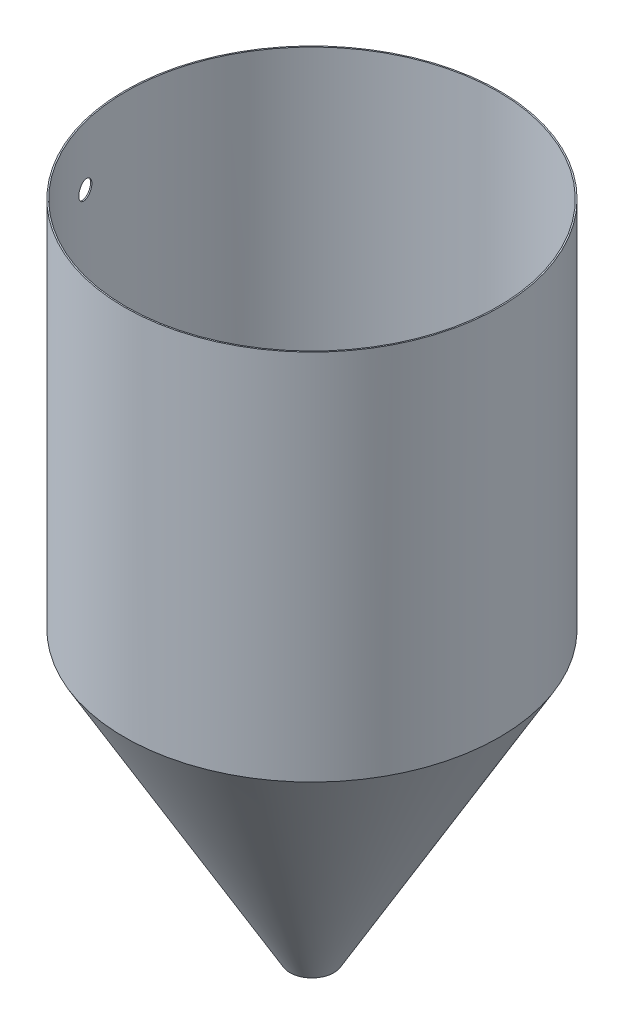
ISO-10303-21;
HEADER;
FILE_DESCRIPTION(('STEP AP214'),'2;1');
FILE_NAME('part.step','',(''),(''),'','','');
FILE_SCHEMA(('AUTOMOTIVE_DESIGN { 1 0 10303 214 1 1 1 1 }'));
ENDSEC;
DATA;
#1=APPLICATION_CONTEXT('core data for automotive mechanical design processes');
#2=APPLICATION_PROTOCOL_DEFINITION('international standard','automotive_design',2000,#1);
#3=PRODUCT_CONTEXT('',#1,'mechanical');
#4=PRODUCT('Part','Part','',(#3));
#5=PRODUCT_RELATED_PRODUCT_CATEGORY('part','',(#4));
#6=PRODUCT_DEFINITION_FORMATION('','',#4);
#7=PRODUCT_DEFINITION_CONTEXT('part definition',#1,'design');
#8=PRODUCT_DEFINITION('design','',#6,#7);
#9=PRODUCT_DEFINITION_SHAPE('','',#8);
#10=(LENGTH_UNIT() NAMED_UNIT(*) SI_UNIT(.MILLI.,.METRE.));
#11=(NAMED_UNIT(*) PLANE_ANGLE_UNIT() SI_UNIT($,.RADIAN.));
#12=(NAMED_UNIT(*) SI_UNIT($,.STERADIAN.) SOLID_ANGLE_UNIT());
#13=UNCERTAINTY_MEASURE_WITH_UNIT(LENGTH_MEASURE(1.E-05),#10,'distance_accuracy_value','');
#14=(GEOMETRIC_REPRESENTATION_CONTEXT(3) GLOBAL_UNCERTAINTY_ASSIGNED_CONTEXT((#13)) GLOBAL_UNIT_ASSIGNED_CONTEXT((#10,
#11,#12)) REPRESENTATION_CONTEXT('',''));
#15=CARTESIAN_POINT('',(0.,0.,0.));
#16=DIRECTION('',(0.,0.,1.));
#17=DIRECTION('',(1.,0.,0.));
#18=AXIS2_PLACEMENT_3D('',#15,#16,#17);
#19=CARTESIAN_POINT('',(0.,457.2,0.));
#20=DIRECTION('',(0.,1.,0.));
#21=DIRECTION('',(0.,0.,1.));
#22=AXIS2_PLACEMENT_3D('',#19,#20,#21);
#23=PLANE('',#22);
#24=CARTESIAN_POINT('',(0.,457.2,0.));
#25=DIRECTION('',(0.,1.,0.));
#26=DIRECTION('',(0.,0.,1.));
#27=AXIS2_PLACEMENT_3D('',#24,#25,#26);
#28=CIRCLE('',#27,230.1875);
#29=CARTESIAN_POINT('',(0.,457.2,230.1875));
#30=VERTEX_POINT('',#29);
#31=EDGE_CURVE('E10',#30,#30,#28,.T.);
#32=ORIENTED_EDGE('',*,*,#31,.T.);
#33=EDGE_LOOP('',(#32));
#34=FACE_BOUND('',#33,.T.);
#35=CARTESIAN_POINT('',(0.,457.2,0.));
#36=DIRECTION('',(0.,1.,0.));
#37=DIRECTION('',(0.,0.,1.));
#38=AXIS2_PLACEMENT_3D('',#35,#36,#37);
#39=CIRCLE('',#38,228.6);
#40=CARTESIAN_POINT('',(0.,457.2,228.6));
#41=VERTEX_POINT('',#40);
#42=EDGE_CURVE('E46',#41,#41,#39,.T.);
#43=ORIENTED_EDGE('',*,*,#42,.F.);
#44=EDGE_LOOP('',(#43));
#45=FACE_BOUND('',#44,.T.);
#46=ADVANCED_FACE('F33',(#34,#45),#23,.T.);
#47=CARTESIAN_POINT('',(0.,457.2,0.));
#48=DIRECTION('',(0.,-1.,0.));
#49=DIRECTION('',(0.,0.,-1.));
#50=AXIS2_PLACEMENT_3D('',#47,#48,#49);
#51=CYLINDRICAL_SURFACE('',#50,230.1875);
#52=CARTESIAN_POINT('',(-225.471725791174,384.980800527484,46.3549999999982));
#53=CARTESIAN_POINT('',(-225.471726088794,385.279183677529,46.3549976588101));
#54=CARTESIAN_POINT('',(-225.469182138422,385.577530948555,46.3673773098593));
#55=CARTESIAN_POINT('',(-225.459013423752,386.17218672122,46.4167973755981));
#56=CARTESIAN_POINT('',(-225.451387320096,386.46849466461,46.4538442911281));
#57=CARTESIAN_POINT('',(-225.431065189782,387.057163545417,46.5523632633025));
#58=CARTESIAN_POINT('',(-225.418363787371,387.349519956839,46.6138612181259));
#59=CARTESIAN_POINT('',(-225.387930993322,387.927889205815,46.7607885061345));
#60=CARTESIAN_POINT('',(-225.370199590479,388.213902029236,46.8462178926335));
#61=CARTESIAN_POINT('',(-225.329781164068,388.777323163729,47.0402453109299));
#62=CARTESIAN_POINT('',(-225.307098342538,389.054738544451,47.1488236954465));
#63=CARTESIAN_POINT('',(-225.25684386315,389.599287527111,47.3883362421777));
#64=CARTESIAN_POINT('',(-225.229272135459,389.866420982117,47.5192707237242));
#65=CARTESIAN_POINT('',(-225.169343533614,390.388500994832,47.8024352432938));
#66=CARTESIAN_POINT('',(-225.136987843247,390.643450546846,47.9546600125473));
#67=CARTESIAN_POINT('',(-225.067604161718,391.13951216302,48.2792527346957));
#68=CARTESIAN_POINT('',(-225.030576158499,391.380624191464,48.4516207395778));
#69=CARTESIAN_POINT('',(-224.95168816233,391.849203572208,48.8165776786266));
#70=CARTESIAN_POINT('',(-224.909793367589,392.076552415832,49.009311232157));
#71=CARTESIAN_POINT('',(-224.82157318955,392.514091797104,49.412427015295));
#72=CARTESIAN_POINT('',(-224.775247790577,392.724282274043,49.6228093073412));
#73=CARTESIAN_POINT('',(-224.678359959954,393.126181476977,50.0596620976033));
#74=CARTESIAN_POINT('',(-224.627797224015,393.317888873552,50.2861337510362));
#75=CARTESIAN_POINT('',(-224.522660789154,393.681630752221,50.7534955612667));
#76=CARTESIAN_POINT('',(-224.468086913849,393.853664368346,50.9943863520316));
#77=CARTESIAN_POINT('',(-224.354073254658,394.180207844103,51.4937065704249));
#78=CARTESIAN_POINT('',(-224.294558936594,394.334307013736,51.7523875930294));
#79=CARTESIAN_POINT('',(-224.171924899898,394.620069933713,52.2810373257607));
#80=CARTESIAN_POINT('',(-224.108805141726,394.75173343794,52.5510061596739));
#81=CARTESIAN_POINT('',(-223.979285579249,394.991895096249,53.1003240690077));
#82=CARTESIAN_POINT('',(-223.912885491278,395.100391242593,53.379673954987));
#83=CARTESIAN_POINT('',(-223.777170953878,395.293631772445,53.9457842789963));
#84=CARTESIAN_POINT('',(-223.707856430761,395.378375554977,54.2325449043304));
#85=CARTESIAN_POINT('',(-223.564911636558,395.525540021225,54.8188724495469));
#86=CARTESIAN_POINT('',(-223.491216468101,395.587339147854,55.1185796509497));
#87=CARTESIAN_POINT('',(-223.341627982758,395.685242128482,55.7216194870634));
#88=CARTESIAN_POINT('',(-223.265734630626,395.721345570239,56.02495217986));
#89=CARTESIAN_POINT('',(-223.112226899023,395.767735355436,56.6331859444567));
#90=CARTESIAN_POINT('',(-223.03461233182,395.77801886861,56.9380871845238));
#91=CARTESIAN_POINT('',(-222.87818526465,395.772785724855,57.5473597713642));
#92=CARTESIAN_POINT('',(-222.7993727517,395.757268788114,57.8517311123547));
#93=CARTESIAN_POINT('',(-222.639311438267,395.699960387531,58.4647307553308));
#94=CARTESIAN_POINT('',(-222.558047718419,395.657585642148,58.7733007656623));
#95=CARTESIAN_POINT('',(-222.395446043872,395.546352405472,59.3856134716125));
#96=CARTESIAN_POINT('',(-222.314108087954,395.477493471184,59.689356086396));
#97=CARTESIAN_POINT('',(-222.152007554056,395.313764007605,60.2898615769973));
#98=CARTESIAN_POINT('',(-222.0712449027,395.218896858742,60.586625354453));
#99=CARTESIAN_POINT('',(-221.910913717958,395.003701129131,61.1712633081152));
#100=CARTESIAN_POINT('',(-221.83134571536,394.883361569628,61.4591335896684));
#101=CARTESIAN_POINT('',(-221.673587554066,394.617076271921,62.0257431961409));
#102=CARTESIAN_POINT('',(-221.595410575798,394.470960693891,62.3044064204936));
#103=CARTESIAN_POINT('',(-221.441755687704,394.154669812374,62.8483399904903));
#104=CARTESIAN_POINT('',(-221.36627660015,393.98450517196,63.1136162014154));
#105=CARTESIAN_POINT('',(-221.218701417868,393.621093980062,63.6289490949543));
#106=CARTESIAN_POINT('',(-221.146605998273,393.427842849246,63.8790027431908));
#107=CARTESIAN_POINT('',(-221.006558424579,393.019520060319,64.3618636600715));
#108=CARTESIAN_POINT('',(-220.938606185424,392.804448850398,64.5946712827839));
#109=CARTESIAN_POINT('',(-220.808804060588,392.358088533879,65.0369845114161));
#110=CARTESIAN_POINT('',(-220.746864245304,392.127175043213,65.2468427247918));
#111=CARTESIAN_POINT('',(-220.628380810602,391.647221640689,65.6463720606007));
#112=CARTESIAN_POINT('',(-220.571836876717,391.398182786654,65.8360443595246));
#113=CARTESIAN_POINT('',(-220.464814703941,390.883716349776,66.1935454605426));
#114=CARTESIAN_POINT('',(-220.414335513676,390.618291347338,66.3613776890249));
#115=CARTESIAN_POINT('',(-220.320058392862,390.072921802553,66.6737103623572));
#116=CARTESIAN_POINT('',(-220.276260227155,389.79297777171,66.8182116284171));
#117=CARTESIAN_POINT('',(-220.197492238482,389.231917254212,67.0773224366206));
#118=CARTESIAN_POINT('',(-220.162243127203,388.95127913094,67.1928834748647));
#119=CARTESIAN_POINT('',(-220.098874600913,388.380549999233,67.4001655350726));
#120=CARTESIAN_POINT('',(-220.070755007299,388.090459227802,67.4918871542387));
#121=CARTESIAN_POINT('',(-220.02201379894,387.503039232471,67.6506134543909));
#122=CARTESIAN_POINT('',(-220.00139062343,387.205711529081,67.7176232804492));
#123=CARTESIAN_POINT('',(-219.967908274268,386.606030605093,67.8263055857097));
#124=CARTESIAN_POINT('',(-219.955048908892,386.303677508783,67.8679786905943));
#125=CARTESIAN_POINT('',(-219.937600356854,385.707682977434,67.9245017668396));
#126=CARTESIAN_POINT('',(-219.932719449883,385.414139412999,67.9402979392579));
#127=CARTESIAN_POINT('',(-219.930372182649,384.826717167376,67.9478959720372));
#128=CARTESIAN_POINT('',(-219.932905611584,384.532838495953,67.9396985145751));
#129=CARTESIAN_POINT('',(-219.945354127785,383.946911589704,67.899387299473));
#130=CARTESIAN_POINT('',(-219.955268569357,383.654863197018,67.8672756338522));
#131=CARTESIAN_POINT('',(-219.982353570734,383.074682834464,67.7794318482165));
#132=CARTESIAN_POINT('',(-219.999524139756,382.786550869571,67.7236996981974));
#133=CARTESIAN_POINT('',(-220.040674977499,382.2194730935,67.5898760682495));
#134=CARTESIAN_POINT('',(-220.064576362939,381.940460366908,67.5120435158373));
#135=CARTESIAN_POINT('',(-220.118980802515,381.390172979682,67.3344493053306));
#136=CARTESIAN_POINT('',(-220.149483775423,381.118898223883,67.2346879170563));
#137=CARTESIAN_POINT('',(-220.216742003339,380.585867274134,67.0140655925355));
#138=CARTESIAN_POINT('',(-220.253497448164,380.324111369455,66.8932040157129));
#139=CARTESIAN_POINT('',(-220.332854174001,379.811783681689,66.6313532360659));
#140=CARTESIAN_POINT('',(-220.37545576305,379.561212488852,66.4903629726349));
#141=CARTESIAN_POINT('',(-220.467012914423,379.067616583437,66.1861550930379));
#142=CARTESIAN_POINT('',(-220.516084168104,378.824865008656,66.0225291449194));
#143=CARTESIAN_POINT('',(-220.619329614987,378.354135538404,65.6767014201152));
#144=CARTESIAN_POINT('',(-220.673503858517,378.126157788677,65.4944994602237));
#145=CARTESIAN_POINT('',(-220.78641603957,377.686293057841,65.1128500601749));
#146=CARTESIAN_POINT('',(-220.845154560295,377.474408139865,64.9134004158175));
#147=CARTESIAN_POINT('',(-220.966627647439,377.06795962211,64.4986922472346));
#148=CARTESIAN_POINT('',(-221.029362364982,376.873396678063,64.2834331250969));
#149=CARTESIAN_POINT('',(-221.160816478872,376.495304139711,63.829745128254));
#150=CARTESIAN_POINT('',(-221.229674584822,376.312519044427,63.5907357219956));
#151=CARTESIAN_POINT('',(-221.370451583808,375.967890763984,63.0989202902954));
#152=CARTESIAN_POINT('',(-221.442370549892,375.806048078993,62.846113935546));
#153=CARTESIAN_POINT('',(-221.588644353269,375.504201426446,62.3284060712114));
#154=CARTESIAN_POINT('',(-221.662999545691,375.364200660074,62.0635027960249));
#155=CARTESIAN_POINT('',(-221.813513230159,375.106851814315,61.523402825781));
#156=CARTESIAN_POINT('',(-221.889671770537,374.98950434284,61.2482058547233));
#157=CARTESIAN_POINT('',(-222.045912361497,374.774373046555,60.6793868831122));
#158=CARTESIAN_POINT('',(-222.126037687907,374.677432181546,60.385457633595));
#159=CARTESIAN_POINT('',(-222.286917321503,374.509160687855,59.7905218498463));
#160=CARTESIAN_POINT('',(-222.367671643997,374.437830684443,59.4895151430151));
#161=CARTESIAN_POINT('',(-222.529188522209,374.321244094155,58.882459746569));
#162=CARTESIAN_POINT('',(-222.609951077895,374.275990261807,58.5764105278046));
#163=CARTESIAN_POINT('',(-222.770871995751,374.211899659563,57.9614076397001));
#164=CARTESIAN_POINT('',(-222.851030369404,374.193062386304,57.6524540258156));
#165=CARTESIAN_POINT('',(-223.011295370396,374.181915307042,57.0293977683801));
#166=CARTESIAN_POINT('',(-223.091385315407,374.189983475448,56.7152839718901));
#167=CARTESIAN_POINT('',(-223.249791121739,374.233524511017,56.0885051564206));
#168=CARTESIAN_POINT('',(-223.328106959608,374.268997740251,55.7758401566372));
#169=CARTESIAN_POINT('',(-223.482430401741,374.367224298065,55.1542474114872));
#170=CARTESIAN_POINT('',(-223.558438031742,374.42997732237,54.8453196244755));
#171=CARTESIAN_POINT('',(-223.707647498081,374.582461507265,54.2335021505579));
#172=CARTESIAN_POINT('',(-223.780849371612,374.672192310099,53.9306123836373));
#173=CARTESIAN_POINT('',(-223.923261508005,374.877098050646,53.3362032487478));
#174=CARTESIAN_POINT('',(-223.992504680613,374.99200617828,53.0445998084584));
#175=CARTESIAN_POINT('',(-224.127379304272,375.247109429878,52.4717979805745));
#176=CARTESIAN_POINT('',(-224.193010764123,375.387304492233,52.1905995676308));
#177=CARTESIAN_POINT('',(-224.320278851407,375.69209525945,51.6408487681667));
#178=CARTESIAN_POINT('',(-224.381915991765,375.856687822394,51.3722947591548));
#179=CARTESIAN_POINT('',(-224.50086656005,376.209214687905,50.8499540594912));
#180=CARTESIAN_POINT('',(-224.558180080396,376.397148491318,50.5961670532161));
#181=CARTESIAN_POINT('',(-224.666842556259,376.790225712222,50.1114279861869));
#182=CARTESIAN_POINT('',(-224.718302833041,376.994838091978,49.8800701507542));
#183=CARTESIAN_POINT('',(-224.816578417777,377.423686676857,49.4352416788607));
#184=CARTESIAN_POINT('',(-224.863393772102,377.647922686037,49.2217708638395));
#185=CARTESIAN_POINT('',(-224.952173738837,378.114495294457,48.8144257673208));
#186=CARTESIAN_POINT('',(-224.994137607427,378.356834659923,48.6205544913644));
#187=CARTESIAN_POINT('',(-225.073023874237,378.857844706535,48.2540592154279));
#188=CARTESIAN_POINT('',(-225.109946441011,379.116514841252,48.0814345051057));
#189=CARTESIAN_POINT('',(-225.177752425007,379.641733463271,47.7628605301758));
#190=CARTESIAN_POINT('',(-225.20876228545,379.907930511002,47.6163585498022));
#191=CARTESIAN_POINT('',(-225.26572690163,380.452162771174,47.3461351867414));
#192=CARTESIAN_POINT('',(-225.291681749866,380.73019776688,47.2224133872069));
#193=CARTESIAN_POINT('',(-225.338416379941,381.29576760747,46.9988967528108));
#194=CARTESIAN_POINT('',(-225.359202265591,381.583290789102,46.8990737021575));
#195=CARTESIAN_POINT('',(-225.395562110896,382.165943506996,46.7240164888562));
#196=CARTESIAN_POINT('',(-225.411137537809,382.461070876673,46.6487754041032));
#197=CARTESIAN_POINT('',(-225.43993910364,383.12372466068,46.5094102623226));
#198=CARTESIAN_POINT('',(-225.451855226266,383.492645624152,46.4515625927159));
#199=CARTESIAN_POINT('',(-225.467748345371,384.23466328785,46.3743591122761));
#200=CARTESIAN_POINT('',(-225.471725419086,384.607759947418,46.355002926967));
#201=CARTESIAN_POINT('',(-225.471725791174,384.980800527484,46.3549999999982));
#202=B_SPLINE_CURVE_WITH_KNOTS('',3,(#52,#53,#54,#55,#56,#57,#58,#59,#60,#61,#62,#63,#64,#65,
#66,#67,#68,#69,#70,#71,#72,#73,#74,#75,#76,#77,#78,#79,#80,#81,#82,#83,#84,#85,#86,#87,#88,#89,
#90,#91,#92,#93,#94,#95,#96,#97,#98,#99,#100,#101,#102,#103,#104,#105,#106,#107,#108,#109,#110,
#111,#112,#113,#114,#115,#116,#117,#118,#119,#120,#121,#122,#123,#124,#125,#126,#127,#128,#129,
#130,#131,#132,#133,#134,#135,#136,#137,#138,#139,#140,#141,#142,#143,#144,#145,#146,#147,#148,
#149,#150,#151,#152,#153,#154,#155,#156,#157,#158,#159,#160,#161,#162,#163,#164,#165,#166,#167,
#168,#169,#170,#171,#172,#173,#174,#175,#176,#177,#178,#179,#180,#181,#182,#183,#184,#185,#186,
#187,#188,#189,#190,#191,#192,#193,#194,#195,#196,#197,#198,#199,#200,#201),.UNSPECIFIED.,.T.,
.F.,(4,2,2,2,2,2,2,2,2,2,2,2,2,2,2,2,2,2,2,2,2,2,2,2,2,2,2,2,2,2,2,2,2,2,2,2,2,2,2,2,2,2,2,2,2,
2,2,2,2,2,2,2,2,2,2,2,2,2,2,2,2,2,2,2,2,2,2,2,2,2,2,2,2,2,4),(0.,0.894820422795079,
1.78987676102129,2.68588366607302,3.58189256724735,4.47714400357919,5.37240822865174,
6.26745129080843,7.16249666301003,8.064389980403,8.96628648869571,9.86824781878641,
10.7702488346591,11.6899712782463,12.6097038104996,13.5295160166542,14.4493514935404,
15.3925465453272,16.3357567287412,17.2790702982015,18.2223940981911,19.1869412131289,
20.1515044625287,21.1159424018401,22.0807968689061,23.0522639775039,24.0233016925047,
24.9945323389736,25.9657430401358,26.918906989603,27.8720153555815,28.824974012038,
29.7778991186716,30.6933777590411,31.6088334635093,32.5240984595009,33.4393408523929,
34.3203027320705,35.2012395648526,36.082099342173,36.9629602384231,37.8338990855472,
38.7048272169265,39.5757817932225,40.4467822781885,41.3362736413983,42.2257737780546,
43.1153877585095,44.0050354013867,44.929996220813,45.8549791270115,46.7800974729607,
47.7052406414989,48.6632450691949,49.6212728842781,50.579401881077,51.5375126206797,
52.5091395230254,53.4807792625726,54.4524081648538,55.4240241827538,56.3858029660815,
57.3475794061292,58.3092320957178,59.2708642238021,60.2090604238087,61.1472472569907,
62.0855777412788,63.0238768455884,63.939043948775,64.8541943039461,65.7682588091638,
66.6820656980959,67.8007869700097,68.919497358057),.UNSPECIFIED.);
#203=CARTESIAN_POINT('',(-225.471725791174,384.980800527484,46.3549999999982));
#204=VERTEX_POINT('',#203);
#205=EDGE_CURVE('E64',#204,#204,#202,.T.);
#206=ORIENTED_EDGE('',*,*,#205,.T.);
#207=EDGE_LOOP('',(#206));
#208=FACE_BOUND('',#207,.T.);
#209=ORIENTED_EDGE('',*,*,#31,.F.);
#210=EDGE_LOOP('',(#209));
#211=FACE_BOUND('',#210,.T.);
#212=CARTESIAN_POINT('',(0.,0.,0.));
#213=DIRECTION('',(0.,1.,0.));
#214=DIRECTION('',(-1.,0.,0.));
#215=AXIS2_PLACEMENT_3D('',#212,#213,#214);
#216=CIRCLE('',#215,230.1875);
#217=CARTESIAN_POINT('',(-230.1875,0.,0.));
#218=VERTEX_POINT('',#217);
#219=EDGE_CURVE('E61',#218,#218,#216,.T.);
#220=ORIENTED_EDGE('',*,*,#219,.T.);
#221=EDGE_LOOP('',(#220));
#222=FACE_BOUND('',#221,.T.);
#223=ADVANCED_FACE('F35',(#208,#211,#222),#51,.T.);
#224=CARTESIAN_POINT('',(0.,457.2,0.));
#225=DIRECTION('',(0.,-1.,0.));
#226=DIRECTION('',(0.,0.,-1.));
#227=AXIS2_PLACEMENT_3D('',#224,#225,#226);
#228=CYLINDRICAL_SURFACE('',#227,228.6);
#229=CARTESIAN_POINT('',(-223.85078506675,384.980800527484,46.3549999999982));
#230=CARTESIAN_POINT('',(-223.850785366799,385.279114677653,46.3549976583635));
#231=CARTESIAN_POINT('',(-223.848224177078,385.57739296995,46.3673715999824));
#232=CARTESIAN_POINT('',(-223.837986585816,386.171911004515,46.4167687084857));
#233=CARTESIAN_POINT('',(-223.830308835498,386.468150188444,46.4537983748606));
#234=CARTESIAN_POINT('',(-223.809849181659,387.056682028594,46.5522709451281));
#235=CARTESIAN_POINT('',(-223.797061865881,387.348970159216,46.6137397355732));
#236=CARTESIAN_POINT('',(-223.766423438356,387.927203871506,46.7605962585818));
#237=CARTESIAN_POINT('',(-223.748572314906,388.213149438514,46.8459840464288));
#238=CARTESIAN_POINT('',(-223.707881453922,388.776436353699,47.0399146852138));
#239=CARTESIAN_POINT('',(-223.685045972227,389.053784813104,47.1484377804912));
#240=CARTESIAN_POINT('',(-223.634453821293,389.598202714085,47.3878256557009));
#241=CARTESIAN_POINT('',(-223.606697081832,389.865272008921,47.5186907544298));
#242=CARTESIAN_POINT('',(-223.546367072192,390.38722781328,47.8017017004241));
#243=CARTESIAN_POINT('',(-223.513794993227,390.642117315253,47.9538422840737));
#244=CARTESIAN_POINT('',(-223.443948189745,391.138064564664,48.2782511608146));
#245=CARTESIAN_POINT('',(-223.406673452699,391.379122275247,48.4505195075329));
#246=CARTESIAN_POINT('',(-223.327256764453,391.847624498763,48.8152791814765));
#247=CARTESIAN_POINT('',(-223.28507931212,392.07494895388,49.0079169678339));
#248=CARTESIAN_POINT('',(-223.196264730558,392.512446042426,49.4108283088885));
#249=CARTESIAN_POINT('',(-223.149627585379,392.722618614508,49.621101926658));
#250=CARTESIAN_POINT('',(-223.052088689399,393.12449083293,50.0577242793516));
#251=CARTESIAN_POINT('',(-223.00118662993,393.316189140052,50.2840741775975));
#252=CARTESIAN_POINT('',(-222.895345674203,393.679924063615,50.7511794676336));
#253=CARTESIAN_POINT('',(-222.840406599216,393.851959808678,50.9919354971352));
#254=CARTESIAN_POINT('',(-222.725615415398,394.178565993885,51.4910389471948));
#255=CARTESIAN_POINT('',(-222.665687235179,394.332720225186,51.7496412662697));
#256=CARTESIAN_POINT('',(-222.542200507265,394.618598236876,52.27812758374));
#257=CARTESIAN_POINT('',(-222.478641919197,394.750321767753,52.548011707589));
#258=CARTESIAN_POINT('',(-222.348221905992,394.990610880901,53.0971548619483));
#259=CARTESIAN_POINT('',(-222.281360191572,395.099174430416,53.3764147128801));
#260=CARTESIAN_POINT('',(-222.144702042697,395.292559280618,53.9423404371074));
#261=CARTESIAN_POINT('',(-222.074905533053,395.377379972585,54.2290065000779));
#262=CARTESIAN_POINT('',(-221.930940863794,395.524738009444,54.8152433415789));
#263=CARTESIAN_POINT('',(-221.856706410747,395.586645217446,55.1149563320913));
#264=CARTESIAN_POINT('',(-221.706021744098,395.684760393676,55.7180089437285));
#265=CARTESIAN_POINT('',(-221.629571494483,395.720967943954,56.0213486237523));
#266=CARTESIAN_POINT('',(-221.47493541134,395.767563353527,56.629598819));
#267=CARTESIAN_POINT('',(-221.396749386046,395.777948345501,56.934509504901));
#268=CARTESIAN_POINT('',(-221.239168324846,395.772916341071,57.5438043900746));
#269=CARTESIAN_POINT('',(-221.15977327553,395.757499058262,57.8481885834658));
#270=CARTESIAN_POINT('',(-220.998499500558,395.700381257109,58.4613203420482));
#271=CARTESIAN_POINT('',(-220.916605455537,395.658088693177,58.7700088622402));
#272=CARTESIAN_POINT('',(-220.752739155159,395.547000700097,59.3825621261169));
#273=CARTESIAN_POINT('',(-220.6707668985,395.478204821327,59.6864267878753));
#274=CARTESIAN_POINT('',(-220.507398480813,395.314581578141,60.2871802786808));
#275=CARTESIAN_POINT('',(-220.426002247103,395.219757560291,60.584069999207));
#276=CARTESIAN_POINT('',(-220.2644093868,395.004627017764,61.1689632031178));
#277=CARTESIAN_POINT('',(-220.184213293614,394.884309502617,61.4569627923407));
#278=CARTESIAN_POINT('',(-220.025195619606,394.618028386066,62.023870977765));
#279=CARTESIAN_POINT('',(-219.946387545339,394.471891586237,62.3027020596631));
#280=CARTESIAN_POINT('',(-219.791488718914,394.155526805605,62.846969049015));
#281=CARTESIAN_POINT('',(-219.715396780532,393.985309506819,63.1124108254662));
#282=CARTESIAN_POINT('',(-219.56662031793,393.621759503745,63.6280698980151));
#283=CARTESIAN_POINT('',(-219.493936473998,393.428422211601,63.8782841575001));
#284=CARTESIAN_POINT('',(-219.352743685153,393.01989184102,64.3614573943775));
#285=CARTESIAN_POINT('',(-219.284234653233,392.804699218319,64.5944167314008));
#286=CARTESIAN_POINT('',(-219.153384047372,392.358116957487,65.0369626744945));
#287=CARTESIAN_POINT('',(-219.090950650705,392.127108478818,65.2469067102704));
#288=CARTESIAN_POINT('',(-218.971522168603,391.646938388861,65.6465992686307));
#289=CARTESIAN_POINT('',(-218.91452676253,391.397777849395,65.8363489819996));
#290=CARTESIAN_POINT('',(-218.806650835089,390.883041652484,66.1939910277505));
#291=CARTESIAN_POINT('',(-218.755769337464,390.617468626038,66.3618868500788));
#292=CARTESIAN_POINT('',(-218.660743386575,390.07177719784,66.674327754602));
#293=CARTESIAN_POINT('',(-218.616598692021,389.791659317519,66.818873673125));
#294=CARTESIAN_POINT('',(-218.537235469987,389.230399421366,67.0779720966146));
#295=CARTESIAN_POINT('',(-218.501731236439,388.949743487425,67.193490642225));
#296=CARTESIAN_POINT('',(-218.437906229677,388.378971658093,67.4006890647035));
#297=CARTESIAN_POINT('',(-218.409585273831,388.088856003425,67.4923695476486));
#298=CARTESIAN_POINT('',(-218.360498938726,387.50138178738,67.6510118599051));
#299=CARTESIAN_POINT('',(-218.339731961242,387.204024772307,67.7179789179742));
#300=CARTESIAN_POINT('',(-218.306022249328,386.604282540207,67.826572170914));
#301=CARTESIAN_POINT('',(-218.29307931843,386.301897449635,67.8681990020991));
#302=CARTESIAN_POINT('',(-218.275532520091,385.70600908824,67.9246106722772));
#303=CARTESIAN_POINT('',(-218.270630395994,385.412605070898,67.9403555968974));
#304=CARTESIAN_POINT('',(-218.268289986967,384.825465262105,67.9478741762559));
#305=CARTESIAN_POINT('',(-218.270851486588,384.531729480475,67.9396485229468));
#306=CARTESIAN_POINT('',(-218.283404985172,383.946091668763,67.8993044969086));
#307=CARTESIAN_POINT('',(-218.293396326231,383.654189478625,67.8671882396681));
#308=CARTESIAN_POINT('',(-218.320682688116,383.074303938295,67.7793598419457));
#309=CARTESIAN_POINT('',(-218.337977718468,382.786320593215,67.7236476706895));
#310=CARTESIAN_POINT('',(-218.379418103204,382.219584273917,67.58990001621));
#311=CARTESIAN_POINT('',(-218.403482970596,381.940763446346,67.5121267333906));
#312=CARTESIAN_POINT('',(-218.458254288627,381.390856821489,67.3346845706075));
#313=CARTESIAN_POINT('',(-218.488960656433,381.119770927782,67.2350159637227));
#314=CARTESIAN_POINT('',(-218.556662802304,380.587111262872,67.0146135183542));
#315=CARTESIAN_POINT('',(-218.593658774927,380.325537786224,66.893879028233));
#316=CARTESIAN_POINT('',(-218.673530609673,379.813564739018,66.6323172319232));
#317=CARTESIAN_POINT('',(-218.716406784081,379.563165762852,66.491488858575));
#318=CARTESIAN_POINT('',(-218.808564364361,379.069826920978,66.187596277501));
#319=CARTESIAN_POINT('',(-218.85796385514,378.827163940745,66.0241184164004));
#320=CARTESIAN_POINT('',(-218.961897494162,378.356600861575,65.678611274671));
#321=CARTESIAN_POINT('',(-219.016431693838,378.128700910551,65.4965818082175));
#322=CARTESIAN_POINT('',(-219.130091806439,377.688976449266,65.1153010539021));
#323=CARTESIAN_POINT('',(-219.189218313222,377.477154025115,64.9160475383153));
#324=CARTESIAN_POINT('',(-219.311491626768,377.070811070722,64.5017541047742));
#325=CARTESIAN_POINT('',(-219.374638587505,376.876291203814,64.2867135821644));
#326=CARTESIAN_POINT('',(-219.506991720707,376.498156702209,63.8333654979012));
#327=CARTESIAN_POINT('',(-219.576339487072,376.315296482145,63.5944697397682));
#328=CARTESIAN_POINT('',(-219.718117681507,375.970511079972,63.1028858007628));
#329=CARTESIAN_POINT('',(-219.790548184171,375.808586404824,62.8501972861055));
#330=CARTESIAN_POINT('',(-219.937862772894,375.506565835807,62.3327272572266));
#331=CARTESIAN_POINT('',(-220.012747221375,375.366473184033,62.0679439544426));
#332=CARTESIAN_POINT('',(-220.164332865492,375.108928619787,61.5280841621663));
#333=CARTESIAN_POINT('',(-220.241034110477,374.991477323087,61.2530073929675));
#334=CARTESIAN_POINT('',(-220.398429451291,374.776065659205,60.6842849322646));
#335=CARTESIAN_POINT('',(-220.479167822738,374.678960316687,60.3903273096858));
#336=CARTESIAN_POINT('',(-220.641280219878,374.510370008092,59.7953220777604));
#337=CARTESIAN_POINT('',(-220.722654261258,374.438885676299,59.4942742930837));
#338=CARTESIAN_POINT('',(-220.885412727456,374.322000814798,58.8871227695488));
#339=CARTESIAN_POINT('',(-220.966797152453,374.276603078592,58.581018492822));
#340=CARTESIAN_POINT('',(-221.12895928428,374.21223622607,57.965891121435));
#341=CARTESIAN_POINT('',(-221.209737002611,374.193266607473,57.6568680823598));
#342=CARTESIAN_POINT('',(-221.371260561441,374.181864982681,57.0335875620787));
#343=CARTESIAN_POINT('',(-221.451989355297,374.189817181455,56.7193185322813));
#344=CARTESIAN_POINT('',(-221.611660660123,374.233154234078,56.0922147212554));
#345=CARTESIAN_POINT('',(-221.690603147113,374.268539455963,55.7793799593253));
#346=CARTESIAN_POINT('',(-221.84616313289,374.366620551899,55.1574352008686));
#347=CARTESIAN_POINT('',(-221.922780657828,374.429316118638,54.8483251624695));
#348=CARTESIAN_POINT('',(-222.073188789977,374.581718638631,54.2361334652565));
#349=CARTESIAN_POINT('',(-222.146979435208,374.671425228457,53.9330517253921));
#350=CARTESIAN_POINT('',(-222.290528415745,374.87630479898,53.3382940521518));
#351=CARTESIAN_POINT('',(-222.360320346997,374.991207135768,53.0465330159338));
#352=CARTESIAN_POINT('',(-222.496264819525,375.246329404452,52.4734112314983));
#353=CARTESIAN_POINT('',(-222.562417369744,375.386549274144,52.19205045773));
#354=CARTESIAN_POINT('',(-222.690696245116,375.691421985662,51.6419748736948));
#355=CARTESIAN_POINT('',(-222.752823092873,375.856071646937,51.3732584232334));
#356=CARTESIAN_POINT('',(-222.872718485279,376.208746426413,50.850597369726));
#357=CARTESIAN_POINT('',(-222.93048712453,376.396771036997,50.596652446073));
#358=CARTESIAN_POINT('',(-223.039992154139,376.78999182895,50.1116970072583));
#359=CARTESIAN_POINT('',(-223.091842359735,376.994648637878,49.8802747363521));
#360=CARTESIAN_POINT('',(-223.190862709573,377.423604372152,49.43531898398));
#361=CARTESIAN_POINT('',(-223.23803290146,377.647903097492,49.2217853204061));
#362=CARTESIAN_POINT('',(-223.327485257485,378.114619207743,48.8143202301834));
#363=CARTESIAN_POINT('',(-223.369766679621,378.357039333894,48.6203917797116));
#364=CARTESIAN_POINT('',(-223.449248834224,378.858228535559,48.2537914438972));
#365=CARTESIAN_POINT('',(-223.486449738025,379.116997059315,48.0811188417475));
#366=CARTESIAN_POINT('',(-223.554752516868,379.642328801676,47.7625220681446));
#367=CARTESIAN_POINT('',(-223.585983692574,379.90853505312,47.6160367836229));
#368=CARTESIAN_POINT('',(-223.643354555992,380.452790615582,47.3458450941793));
#369=CARTESIAN_POINT('',(-223.669494338555,380.730839705854,47.2221382649053));
#370=CARTESIAN_POINT('',(-223.71656122102,381.296441545773,46.9986518550325));
#371=CARTESIAN_POINT('',(-223.737494478789,381.583982608524,46.8988440138605));
#372=CARTESIAN_POINT('',(-223.774110966289,382.166674331074,46.7238187980138));
#373=CARTESIAN_POINT('',(-223.789795675797,382.461822820716,46.6485944923928));
#374=CARTESIAN_POINT('',(-223.818790669411,383.124372397442,46.5093019489884));
#375=CARTESIAN_POINT('',(-223.830784639138,383.493164967297,46.4514949443594));
#376=CARTESIAN_POINT('',(-223.846781610867,384.234923905798,46.3743456231114));
#377=CARTESIAN_POINT('',(-223.85078469167,384.60789023325,46.3550029271799));
#378=CARTESIAN_POINT('',(-223.85078506675,384.980800527484,46.3549999999982));
#379=B_SPLINE_CURVE_WITH_KNOTS('',3,(#229,#230,#231,#232,#233,#234,#235,#236,#237,#238,#239,
#240,#241,#242,#243,#244,#245,#246,#247,#248,#249,#250,#251,#252,#253,#254,#255,#256,#257,#258,
#259,#260,#261,#262,#263,#264,#265,#266,#267,#268,#269,#270,#271,#272,#273,#274,#275,#276,#277,
#278,#279,#280,#281,#282,#283,#284,#285,#286,#287,#288,#289,#290,#291,#292,#293,#294,#295,#296,
#297,#298,#299,#300,#301,#302,#303,#304,#305,#306,#307,#308,#309,#310,#311,#312,#313,#314,#315,
#316,#317,#318,#319,#320,#321,#322,#323,#324,#325,#326,#327,#328,#329,#330,#331,#332,#333,#334,
#335,#336,#337,#338,#339,#340,#341,#342,#343,#344,#345,#346,#347,#348,#349,#350,#351,#352,#353,
#354,#355,#356,#357,#358,#359,#360,#361,#362,#363,#364,#365,#366,#367,#368,#369,#370,#371,#372,
#373,#374,#375,#376,#377,#378),.UNSPECIFIED.,.T.,.F.,(4,2,2,2,2,2,2,2,2,2,2,2,2,2,2,2,2,2,2,2,2,
2,2,2,2,2,2,2,2,2,2,2,2,2,2,2,2,2,2,2,2,2,2,2,2,2,2,2,2,2,2,2,2,2,2,2,2,2,2,2,2,2,2,2,2,2,2,2,2,
2,2,2,2,2,4),(0.,0.894613489001941,1.7894629002957,2.68526269528091,3.58106456073043,
4.47610452692682,5.3711572654656,6.26598895588268,7.16082303048389,8.06259604067662,
8.9643722760881,9.86621383301205,10.7680953410326,11.6879436298213,12.6078021500459,
13.5277413732288,14.4477041797025,15.3913594554734,16.3350300774477,17.2788054793441,
18.2225913572005,19.1879251560271,20.1532753321748,21.1185014465403,22.0841445280852,
23.0565298395592,24.0284851493873,25.0006336519475,25.9727618870781,26.9265901862866,
27.8803622105694,28.8339817353374,29.787567096554,30.7031342548698,31.6186781328336,
32.5340281928444,33.4493552666983,34.3298922163159,35.2104037479476,36.0908373204585,
36.9712720412563,37.841652107977,38.712021319914,39.5824174600195,40.4528598429318,
41.3420533780667,42.2312558208006,43.1205734438107,44.0099251462132,44.9350847937246,
45.860266840053,46.7855861469264,47.7109306159729,48.6696250370993,49.6283431903679,
50.5871639894896,51.5459665654028,52.5185096882826,53.4910658588381,54.4636110859247,
55.436143228268,56.3987001988865,57.3612548045949,58.3236842036114,59.286092705871,
60.2247107087685,61.1633191552711,62.1020698743191,63.0407889273715,63.9560232799288,
64.8712405803602,65.785370231077,66.6992419343395,67.8175726241175,68.9358922855209),.UNSPECIFIED.);
#380=CARTESIAN_POINT('',(-223.85078506675,384.980800527484,46.3549999999982));
#381=VERTEX_POINT('',#380);
#382=EDGE_CURVE('E38',#381,#381,#379,.T.);
#383=ORIENTED_EDGE('',*,*,#382,.F.);
#384=EDGE_LOOP('',(#383));
#385=FACE_BOUND('',#384,.T.);
#386=ORIENTED_EDGE('',*,*,#42,.T.);
#387=EDGE_LOOP('',(#386));
#388=FACE_BOUND('',#387,.T.);
#389=CARTESIAN_POINT('',(0.,0.,0.));
#390=DIRECTION('',(0.,1.,0.));
#391=DIRECTION('',(0.,0.,1.));
#392=AXIS2_PLACEMENT_3D('',#389,#390,#391);
#393=CIRCLE('',#392,228.6);
#394=CARTESIAN_POINT('',(0.,0.,228.6));
#395=VERTEX_POINT('',#394);
#396=EDGE_CURVE('E50',#395,#395,#393,.T.);
#397=ORIENTED_EDGE('',*,*,#396,.F.);
#398=EDGE_LOOP('',(#397));
#399=FACE_BOUND('',#398,.T.);
#400=ADVANCED_FACE('F84',(#385,#388,#399),#228,.F.);
#401=CARTESIAN_POINT('',(0.,0.,0.));
#402=DIRECTION('',(0.,1.,0.));
#403=DIRECTION('',(-1.,0.,0.));
#404=AXIS2_PLACEMENT_3D('',#401,#402,#403);
#405=CONICAL_SURFACE('',#404,228.6,0.523598775598299);
#406=CARTESIAN_POINT('',(0.,-351.952724097996,0.));
#407=DIRECTION('',(0.,1.,0.));
#408=DIRECTION('',(-1.,0.,0.));
#409=AXIS2_PLACEMENT_3D('',#406,#407,#408);
#410=CIRCLE('',#409,25.4);
#411=CARTESIAN_POINT('',(-25.4,-351.952724097996,0.));
#412=VERTEX_POINT('',#411);
#413=EDGE_CURVE('E54',#412,#412,#410,.T.);
#414=ORIENTED_EDGE('',*,*,#413,.F.);
#415=EDGE_LOOP('',(#414));
#416=FACE_BOUND('',#415,.T.);
#417=ORIENTED_EDGE('',*,*,#396,.T.);
#418=EDGE_LOOP('',(#417));
#419=FACE_BOUND('',#418,.T.);
#420=ADVANCED_FACE('F81',(#416,#419),#405,.F.);
#421=CARTESIAN_POINT('',(25.4000000000001,-351.952724097996,0.));
#422=DIRECTION('',(0.,1.,0.));
#423=DIRECTION('',(-1.,0.,0.));
#424=AXIS2_PLACEMENT_3D('',#421,#422,#423);
#425=PLANE('',#424);
#426=CARTESIAN_POINT('',(0.,-351.952724097996,0.));
#427=DIRECTION('',(0.,1.,0.));
#428=DIRECTION('',(-1.,0.,0.));
#429=AXIS2_PLACEMENT_3D('',#426,#427,#428);
#430=CIRCLE('',#429,26.9875000000001);
#431=CARTESIAN_POINT('',(-26.9875,-351.952724097996,0.));
#432=VERTEX_POINT('',#431);
#433=EDGE_CURVE('E58',#432,#432,#430,.T.);
#434=ORIENTED_EDGE('',*,*,#433,.F.);
#435=EDGE_LOOP('',(#434));
#436=FACE_BOUND('',#435,.T.);
#437=ORIENTED_EDGE('',*,*,#413,.T.);
#438=EDGE_LOOP('',(#437));
#439=FACE_BOUND('',#438,.T.);
#440=ADVANCED_FACE('F77',(#436,#439),#425,.F.);
#441=CARTESIAN_POINT('',(0.,-351.952724097996,0.));
#442=DIRECTION('',(0.,1.,0.));
#443=DIRECTION('',(-1.,0.,0.));
#444=AXIS2_PLACEMENT_3D('',#441,#442,#443);
#445=CONICAL_SURFACE('',#444,26.9875000000001,0.523598775598299);
#446=ORIENTED_EDGE('',*,*,#219,.F.);
#447=EDGE_LOOP('',(#446));
#448=FACE_BOUND('',#447,.T.);
#449=ORIENTED_EDGE('',*,*,#433,.T.);
#450=EDGE_LOOP('',(#449));
#451=FACE_BOUND('',#450,.T.);
#452=ADVANCED_FACE('F72',(#448,#451),#445,.T.);
#453=CARTESIAN_POINT('',(-304.8,384.980800527484,57.1499999999982));
#454=DIRECTION('',(1.,0.,0.));
#455=DIRECTION('',(0.,0.,-1.));
#456=AXIS2_PLACEMENT_3D('',#453,#454,#455);
#457=CYLINDRICAL_SURFACE('',#456,10.795);
#458=ORIENTED_EDGE('',*,*,#382,.T.);
#459=EDGE_LOOP('',(#458));
#460=FACE_BOUND('',#459,.T.);
#461=ORIENTED_EDGE('',*,*,#205,.F.);
#462=EDGE_LOOP('',(#461));
#463=FACE_BOUND('',#462,.T.);
#464=ADVANCED_FACE('F68',(#460,#463),#457,.F.);
#465=CLOSED_SHELL('',(#46,#223,#400,#420,#440,#452,#464));
#466=MANIFOLD_SOLID_BREP('B2',#465);
#467=ADVANCED_BREP_SHAPE_REPRESENTATION('',(#18,#466),#14);
#468=SHAPE_DEFINITION_REPRESENTATION(#9,#467);
ENDSEC;
END-ISO-10303-21;
